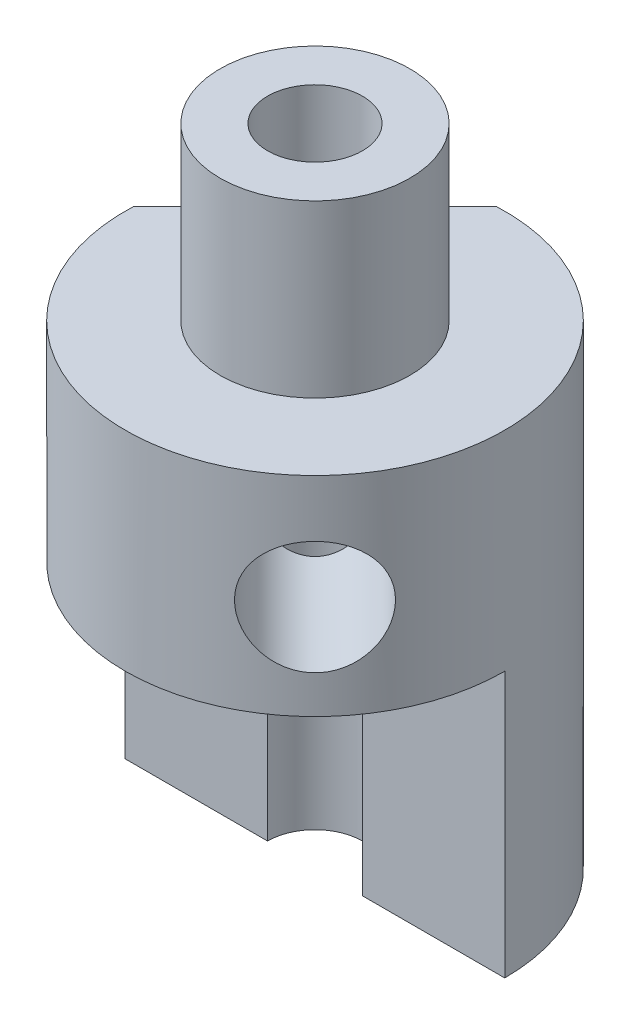
ISO-10303-21;
HEADER;
FILE_DESCRIPTION(('STEP AP214'),'2;1');
FILE_NAME('part.step','',(''),(''),'','','');
FILE_SCHEMA(('AUTOMOTIVE_DESIGN { 1 0 10303 214 1 1 1 1 }'));
ENDSEC;
DATA;
#1=APPLICATION_CONTEXT('core data for automotive mechanical design processes');
#2=APPLICATION_PROTOCOL_DEFINITION('international standard','automotive_design',2000,#1);
#3=PRODUCT_CONTEXT('',#1,'mechanical');
#4=PRODUCT('Part','Part','',(#3));
#5=PRODUCT_RELATED_PRODUCT_CATEGORY('part','',(#4));
#6=PRODUCT_DEFINITION_FORMATION('','',#4);
#7=PRODUCT_DEFINITION_CONTEXT('part definition',#1,'design');
#8=PRODUCT_DEFINITION('design','',#6,#7);
#9=PRODUCT_DEFINITION_SHAPE('','',#8);
#10=(LENGTH_UNIT() NAMED_UNIT(*) SI_UNIT(.MILLI.,.METRE.));
#11=(NAMED_UNIT(*) PLANE_ANGLE_UNIT() SI_UNIT($,.RADIAN.));
#12=(NAMED_UNIT(*) SI_UNIT($,.STERADIAN.) SOLID_ANGLE_UNIT());
#13=UNCERTAINTY_MEASURE_WITH_UNIT(LENGTH_MEASURE(1.E-05),#10,'distance_accuracy_value','');
#14=(GEOMETRIC_REPRESENTATION_CONTEXT(3) GLOBAL_UNCERTAINTY_ASSIGNED_CONTEXT((#13)) GLOBAL_UNIT_ASSIGNED_CONTEXT((#10,
#11,#12)) REPRESENTATION_CONTEXT('',''));
#15=CARTESIAN_POINT('',(0.,0.,0.));
#16=DIRECTION('',(0.,0.,1.));
#17=DIRECTION('',(1.,0.,0.));
#18=AXIS2_PLACEMENT_3D('',#15,#16,#17);
#19=CARTESIAN_POINT('',(0.,0.,0.));
#20=DIRECTION('',(0.,1.,0.));
#21=DIRECTION('',(0.,0.,1.));
#22=AXIS2_PLACEMENT_3D('',#19,#20,#21);
#23=CYLINDRICAL_SURFACE('',#22,5.);
#24=DIRECTION('',(0.,1.,0.));
#25=VECTOR('',#24,1.);
#26=CARTESIAN_POINT('',(-4.99547667712567,0.,-0.212632942634737));
#27=LINE('',#26,#25);
#28=CARTESIAN_POINT('',(-4.99547667712567,-17.,-0.212632942634736));
#29=VERTEX_POINT('',#28);
#30=CARTESIAN_POINT('',(-4.99547667712567,-4.5,-0.212632942634736));
#31=VERTEX_POINT('',#30);
#32=EDGE_CURVE('E11',#29,#31,#27,.T.);
#33=ORIENTED_EDGE('',*,*,#32,.F.);
#34=CARTESIAN_POINT('',(0.,-17.,0.));
#35=DIRECTION('',(0.,1.,0.));
#36=DIRECTION('',(0.,0.,1.));
#37=AXIS2_PLACEMENT_3D('',#34,#35,#36);
#38=CIRCLE('',#37,5.);
#39=CARTESIAN_POINT('',(-5.,-17.,0.));
#40=VERTEX_POINT('',#39);
#41=EDGE_CURVE('E99',#29,#40,#38,.T.);
#42=ORIENTED_EDGE('',*,*,#41,.T.);
#43=DIRECTION('',(0.,-1.,0.));
#44=VECTOR('',#43,1.);
#45=CARTESIAN_POINT('',(-5.,-10.,0.));
#46=LINE('',#45,#44);
#47=CARTESIAN_POINT('',(-5.,-10.,0.));
#48=VERTEX_POINT('',#47);
#49=EDGE_CURVE('E149',#48,#40,#46,.T.);
#50=ORIENTED_EDGE('',*,*,#49,.F.);
#51=CARTESIAN_POINT('',(0.,-10.,0.));
#52=DIRECTION('',(0.,-1.,0.));
#53=DIRECTION('',(0.,0.,-1.));
#54=AXIS2_PLACEMENT_3D('',#51,#52,#53);
#55=CIRCLE('',#54,5.);
#56=CARTESIAN_POINT('',(5.,-10.,0.));
#57=VERTEX_POINT('',#56);
#58=EDGE_CURVE('E135',#48,#57,#55,.F.);
#59=ORIENTED_EDGE('',*,*,#58,.T.);
#60=DIRECTION('',(0.,-1.,0.));
#61=VECTOR('',#60,1.);
#62=CARTESIAN_POINT('',(5.,-10.,0.));
#63=LINE('',#62,#61);
#64=CARTESIAN_POINT('',(5.,-17.,0.));
#65=VERTEX_POINT('',#64);
#66=EDGE_CURVE('E110',#57,#65,#63,.T.);
#67=ORIENTED_EDGE('',*,*,#66,.T.);
#68=CARTESIAN_POINT('',(-0.212632942634616,-17.,-4.99547667712567));
#69=VERTEX_POINT('',#68);
#70=EDGE_CURVE('E107',#65,#69,#38,.T.);
#71=ORIENTED_EDGE('',*,*,#70,.T.);
#72=DIRECTION('',(0.,1.,0.));
#73=VECTOR('',#72,1.);
#74=CARTESIAN_POINT('',(-0.212632942634617,0.,-4.99547667712567));
#75=LINE('',#74,#73);
#76=CARTESIAN_POINT('',(-0.212632942634617,-4.5,-4.99547667712567));
#77=VERTEX_POINT('',#76);
#78=EDGE_CURVE('E44',#77,#69,#75,.F.);
#79=ORIENTED_EDGE('',*,*,#78,.F.);
#80=CARTESIAN_POINT('',(0.,-4.5,0.));
#81=DIRECTION('',(0.,1.,0.));
#82=DIRECTION('',(0.,0.,1.));
#83=AXIS2_PLACEMENT_3D('',#80,#81,#82);
#84=CIRCLE('',#83,5.);
#85=EDGE_CURVE('E102',#31,#77,#84,.T.);
#86=ORIENTED_EDGE('',*,*,#85,.F.);
#87=EDGE_LOOP('',(#33,#42,#50,#59,#67,#71,#79,#86));
#88=FACE_BOUND('',#87,.T.);
#89=CARTESIAN_POINT('',(2.31202421902814,-7.5,4.43334456258786));
#90=CARTESIAN_POINT('',(2.31202554403836,-7.4178054520576,4.43334443992089));
#91=CARTESIAN_POINT('',(2.31833642927138,-7.33560077585598,4.4300699345926));
#92=CARTESIAN_POINT('',(2.34321564064254,-7.17359475040806,4.41695964010886));
#93=CARTESIAN_POINT('',(2.36178806233061,-7.09379421349854,4.40712165863548));
#94=CARTESIAN_POINT('',(2.41012643552735,-6.93896527172827,4.38087197181145));
#95=CARTESIAN_POINT('',(2.43987376793344,-6.86392917036692,4.36447119812477));
#96=CARTESIAN_POINT('',(2.50910131305909,-6.7203780660047,4.32504234678054));
#97=CARTESIAN_POINT('',(2.5485829827509,-6.65186404131556,4.30201327695633));
#98=CARTESIAN_POINT('',(2.63681609316764,-6.52113360942263,4.24852110256376));
#99=CARTESIAN_POINT('',(2.68580086658521,-6.45915410205372,4.2178637750193));
#100=CARTESIAN_POINT('',(2.7902521138083,-6.34536204867749,4.14950401628171));
#101=CARTESIAN_POINT('',(2.84571941932356,-6.29355080955012,4.11180068071226));
#102=CARTESIAN_POINT('',(2.962226370514,-6.20053730016669,4.0287009933826));
#103=CARTESIAN_POINT('',(3.02335752947627,-6.15957657555719,3.98316167701538));
#104=CARTESIAN_POINT('',(3.14784119759628,-6.09101274095724,3.88552984554576));
#105=CARTESIAN_POINT('',(3.21119322451307,-6.06340675014255,3.83343874682251));
#106=CARTESIAN_POINT('',(3.33595486065659,-6.02311999890949,3.72532158709201));
#107=CARTESIAN_POINT('',(3.39736819287551,-6.0100348723473,3.66945071855999));
#108=CARTESIAN_POINT('',(3.51800486407127,-5.99788267535356,3.55395675199789));
#109=CARTESIAN_POINT('',(3.57722866040967,-5.99881266059804,3.49433444469879));
#110=CARTESIAN_POINT('',(3.6898721194699,-6.01439286854303,3.37510897121297));
#111=CARTESIAN_POINT('',(3.7434165606575,-6.02860519380987,3.31556566784947));
#112=CARTESIAN_POINT('',(3.84553265451831,-6.06963133599429,3.19656530524125));
#113=CARTESIAN_POINT('',(3.89410399203609,-6.09644595094267,3.13710825169745));
#114=CARTESIAN_POINT('',(3.98596059760719,-6.16221202341856,3.01956154086991));
#115=CARTESIAN_POINT('',(4.02917770912893,-6.20130120280727,2.9614958755202));
#116=CARTESIAN_POINT('',(4.10918211709999,-6.29039785242823,2.84945063455309));
#117=CARTESIAN_POINT('',(4.14596788437744,-6.34040791296349,2.79547203243603));
#118=CARTESIAN_POINT('',(4.21419801434425,-6.4521977507516,2.69157015929375));
#119=CARTESIAN_POINT('',(4.24538181032643,-6.51435691902974,2.64188342710003));
#120=CARTESIAN_POINT('',(4.30056426843165,-6.64751001789005,2.5510738826623));
#121=CARTESIAN_POINT('',(4.32456221656939,-6.71850482538923,2.5099519215368));
#122=CARTESIAN_POINT('',(4.36561998102409,-6.86823946924899,2.4378489715776));
#123=CARTESIAN_POINT('',(4.38261105977231,-6.94704704586292,2.406969007475));
#124=CARTESIAN_POINT('',(4.40937473672971,-7.10960720844554,2.3575861421563));
#125=CARTESIAN_POINT('',(4.41914968986494,-7.19335817153456,2.33907920328661));
#126=CARTESIAN_POINT('',(4.43129408808536,-7.36008236073928,2.31598740086666));
#127=CARTESIAN_POINT('',(4.43392597648714,-7.44296822389398,2.31090933495105));
#128=CARTESIAN_POINT('',(4.43254934299383,-7.60847290000987,2.31354905591375));
#129=CARTESIAN_POINT('',(4.42854175063192,-7.69109174873085,2.32126505161221));
#130=CARTESIAN_POINT('',(4.41406686187904,-7.85148837797087,2.34866786614158));
#131=CARTESIAN_POINT('',(4.40377008472262,-7.92933616426352,2.36803849140195));
#132=CARTESIAN_POINT('',(4.37683342493547,-8.08040169081492,2.41746064794916));
#133=CARTESIAN_POINT('',(4.36019256290481,-8.15361871414057,2.44751382836057));
#134=CARTESIAN_POINT('',(4.31998194950394,-8.29551746407213,2.5178231442573));
#135=CARTESIAN_POINT('',(4.29623821612194,-8.36402472098579,2.55833147498572));
#136=CARTESIAN_POINT('',(4.24195838032207,-8.4926381061808,2.64735761279482));
#137=CARTESIAN_POINT('',(4.21142065181078,-8.55274221761279,2.69587733662628));
#138=CARTESIAN_POINT('',(4.14229620181627,-8.66518040581474,2.80097809014154));
#139=CARTESIAN_POINT('',(4.10344920377482,-8.71713562898698,2.85779424855102));
#140=CARTESIAN_POINT('',(4.0187072541858,-8.80896670102775,2.97577879668649));
#141=CARTESIAN_POINT('',(3.97281265282395,-8.84884314978146,3.03694697008586));
#142=CARTESIAN_POINT('',(3.87494177347524,-8.9150000305683,3.1608551345975));
#143=CARTESIAN_POINT('',(3.82301464229707,-8.94138201615898,3.2235795452011));
#144=CARTESIAN_POINT('',(3.71385899712308,-8.98006091889042,3.34875152909497));
#145=CARTESIAN_POINT('',(3.65663200498938,-8.99236186594842,3.41119917649425));
#146=CARTESIAN_POINT('',(3.54070822676473,-9.0022230440545,3.53130066052485));
#147=CARTESIAN_POINT('',(3.48215291031679,-9.00033269540783,3.58904649569499));
#148=CARTESIAN_POINT('',(3.36332028629709,-8.98317836750088,3.70063777145006));
#149=CARTESIAN_POINT('',(3.30304307654892,-8.96791514651956,3.75448343299824));
#150=CARTESIAN_POINT('',(3.18337766679835,-8.92478833860038,3.85645254842059));
#151=CARTESIAN_POINT('',(3.12398687100955,-8.89706181935099,3.90463124048538));
#152=CARTESIAN_POINT('',(3.00739315885611,-8.82991808549281,3.9951269160973));
#153=CARTESIAN_POINT('',(2.95019060377821,-8.79049894971381,4.03744293469287));
#154=CARTESIAN_POINT('',(2.83814119214532,-8.69962654256996,4.11701719288622));
#155=CARTESIAN_POINT('',(2.78342827695233,-8.64782856999923,4.15407027313075));
#156=CARTESIAN_POINT('',(2.68042812035858,-8.5342896116672,4.22126693047114));
#157=CARTESIAN_POINT('',(2.63214273702938,-8.47254576210185,4.25140851140175));
#158=CARTESIAN_POINT('',(2.54264575594487,-8.33865922168949,4.305551624071));
#159=CARTESIAN_POINT('',(2.50168788044889,-8.26626144660956,4.32934338024627));
#160=CARTESIAN_POINT('',(2.43066707268165,-8.11444482583898,4.36961486920421));
#161=CARTESIAN_POINT('',(2.40059890579733,-8.03502937639881,4.38609811599731));
#162=CARTESIAN_POINT('',(2.35555564624654,-7.88025956839373,4.41043542393915));
#163=CARTESIAN_POINT('',(2.33930224282493,-7.80539135306901,4.41902857163297));
#164=CARTESIAN_POINT('',(2.31753698650748,-7.65368477750423,4.43048262371999));
#165=CARTESIAN_POINT('',(2.31202298022558,-7.57684681535475,4.43334467727388));
#166=CARTESIAN_POINT('',(2.31202421902814,-7.5,4.43334456258786));
#167=B_SPLINE_CURVE_WITH_KNOTS('',3,(#89,#90,#91,#92,#93,#94,#95,#96,#97,#98,#99,#100,#101,#102,
#103,#104,#105,#106,#107,#108,#109,#110,#111,#112,#113,#114,#115,#116,#117,#118,#119,#120,#121,
#122,#123,#124,#125,#126,#127,#128,#129,#130,#131,#132,#133,#134,#135,#136,#137,#138,#139,#140,
#141,#142,#143,#144,#145,#146,#147,#148,#149,#150,#151,#152,#153,#154,#155,#156,#157,#158,#159,
#160,#161,#162,#163,#164,#165,#166),.UNSPECIFIED.,.T.,.F.,(4,2,2,2,2,2,2,2,2,2,2,2,2,2,2,2,2,2,
2,2,2,2,2,2,2,2,2,2,2,2,2,2,2,2,2,2,2,2,4),(0.,0.246300165915542,0.492682641688999,
0.738656414466192,0.984667025370099,1.23773150007984,1.49082847871273,1.74915939273644,
2.00743455587877,2.25832140149557,2.5091555410144,2.7520012599088,2.99486235890376,
3.24055209335676,3.4863001659083,3.74152147023277,3.99676812491863,4.25446238246266,
4.51207250628411,4.76008080790309,5.00805439107387,5.24958594938817,5.49115481045787,
5.73920731809388,5.98731925928922,6.24479506100602,6.50225807324202,6.75775391814325,
7.01317662321682,7.2587630391122,7.50433553047754,7.74727096872218,7.99024634491378,
8.24099627054488,8.4918185262989,8.75011639669147,9.00828993963944,9.23861153857447,
9.46888695033559),.UNSPECIFIED.);
#168=CARTESIAN_POINT('',(2.31202421902814,-7.5,4.43334456258786));
#169=VERTEX_POINT('',#168);
#170=EDGE_CURVE('E280',#169,#169,#167,.T.);
#171=ORIENTED_EDGE('',*,*,#170,.T.);
#172=EDGE_LOOP('',(#171));
#173=FACE_BOUND('',#172,.T.);
#174=ADVANCED_FACE('F35',(#88,#173),#23,.T.);
#175=CARTESIAN_POINT('',(0.,0.,0.));
#176=DIRECTION('',(0.,1.,0.));
#177=DIRECTION('',(0.,0.,1.));
#178=AXIS2_PLACEMENT_3D('',#175,#176,#177);
#179=CYLINDRICAL_SURFACE('',#178,1.25);
#180=CARTESIAN_POINT('',(0.,-17.,0.));
#181=DIRECTION('',(0.,1.,0.));
#182=DIRECTION('',(0.,0.,1.));
#183=AXIS2_PLACEMENT_3D('',#180,#181,#182);
#184=CIRCLE('',#183,1.25);
#185=CARTESIAN_POINT('',(1.25,-17.,0.));
#186=VERTEX_POINT('',#185);
#187=CARTESIAN_POINT('',(-1.25,-17.,0.));
#188=VERTEX_POINT('',#187);
#189=EDGE_CURVE('E109',#186,#188,#184,.T.);
#190=ORIENTED_EDGE('',*,*,#189,.F.);
#191=DIRECTION('',(0.,-1.,0.));
#192=VECTOR('',#191,1.);
#193=CARTESIAN_POINT('',(1.25,-10.,0.));
#194=LINE('',#193,#192);
#195=CARTESIAN_POINT('',(1.25,-10.,0.));
#196=VERTEX_POINT('',#195);
#197=EDGE_CURVE('E145',#196,#186,#194,.T.);
#198=ORIENTED_EDGE('',*,*,#197,.F.);
#199=CARTESIAN_POINT('',(0.,-10.,0.));
#200=DIRECTION('',(0.,-1.,0.));
#201=DIRECTION('',(0.,0.,-1.));
#202=AXIS2_PLACEMENT_3D('',#199,#200,#201);
#203=CIRCLE('',#202,1.25);
#204=CARTESIAN_POINT('',(-1.25,-10.,0.));
#205=VERTEX_POINT('',#204);
#206=EDGE_CURVE('E141',#205,#196,#203,.F.);
#207=ORIENTED_EDGE('',*,*,#206,.F.);
#208=DIRECTION('',(0.,-1.,0.));
#209=VECTOR('',#208,1.);
#210=CARTESIAN_POINT('',(-1.25,-10.,0.));
#211=LINE('',#210,#209);
#212=EDGE_CURVE('E147',#205,#188,#211,.T.);
#213=ORIENTED_EDGE('',*,*,#212,.T.);
#214=EDGE_LOOP('',(#190,#198,#207,#213));
#215=FACE_BOUND('',#214,.T.);
#216=CARTESIAN_POINT('',(0.,-8.71191996435409,1.25));
#217=CARTESIAN_POINT('',(0.0639913786883656,-8.74491737996399,1.25000210695445));
#218=CARTESIAN_POINT('',(0.128616767662696,-8.77688583088534,1.24509719611039));
#219=CARTESIAN_POINT('',(0.258294541845827,-8.83666040379786,1.22478126862897));
#220=CARTESIAN_POINT('',(0.323347336264017,-8.86446164140774,1.20935803914988));
#221=CARTESIAN_POINT('',(0.441671247693465,-8.90968201894588,1.17074105287275));
#222=CARTESIAN_POINT('',(0.495122135055814,-8.92805644328683,1.14924019172275));
#223=CARTESIAN_POINT('',(0.599796765359746,-8.95912297532618,1.09823675348599));
#224=CARTESIAN_POINT('',(0.651023107976122,-8.97182188628122,1.06874382503994));
#225=CARTESIAN_POINT('',(0.74990357411805,-8.99056999301902,1.00186104326818));
#226=CARTESIAN_POINT('',(0.797533555210043,-8.99657743111183,0.964423317014416));
#227=CARTESIAN_POINT('',(0.887031420698439,-9.00121689671856,0.882801857054179));
#228=CARTESIAN_POINT('',(0.928900542896059,-8.99985051114752,0.838619576826768));
#229=CARTESIAN_POINT('',(1.00158743680936,-8.99039163423168,0.749854910127929));
#230=CARTESIAN_POINT('',(1.03309189631108,-8.98298605598361,0.705755200232642));
#231=CARTESIAN_POINT('',(1.08969812090732,-8.96288872286083,0.614760813845057));
#232=CARTESIAN_POINT('',(1.11479861218082,-8.95019591761728,0.567865583577391));
#233=CARTESIAN_POINT('',(1.15957996065309,-8.91956921032483,0.470021603129293));
#234=CARTESIAN_POINT('',(1.17891046603615,-8.90139677091312,0.418988942514881));
#235=CARTESIAN_POINT('',(1.2105123063233,-8.86119815932786,0.316306111798867));
#236=CARTESIAN_POINT('',(1.22278221530482,-8.83917120988736,0.264655819111829));
#237=CARTESIAN_POINT('',(1.24483493911936,-8.78128814921685,0.137184121716145));
#238=CARTESIAN_POINT('',(1.25072990818731,-8.74380225398072,0.0614266155994452));
#239=CARTESIAN_POINT('',(1.24912050790715,-8.66589103957398,-0.0887794993168474));
#240=CARTESIAN_POINT('',(1.24155366970181,-8.62545285598344,-0.163220378518302));
#241=CARTESIAN_POINT('',(1.22019569515393,-8.56517196613941,-0.27398153283932));
#242=CARTESIAN_POINT('',(1.21127695073219,-8.54495462647527,-0.311093114094432));
#243=CARTESIAN_POINT('',(1.18991084432896,-8.50540589727714,-0.384821518532987));
#244=CARTESIAN_POINT('',(1.17746133875979,-8.48607505425888,-0.421438026956768));
#245=CARTESIAN_POINT('',(1.14894616850438,-8.44927258255515,-0.493891514925132));
#246=CARTESIAN_POINT('',(1.13290354041102,-8.43179011064349,-0.52973193185923));
#247=CARTESIAN_POINT('',(1.09691425500736,-8.39968661839554,-0.60071603443615));
#248=CARTESIAN_POINT('',(1.07697208864192,-8.38506234476099,-0.635860470817283));
#249=CARTESIAN_POINT('',(1.03344256035427,-8.36039175211665,-0.70434511822623));
#250=CARTESIAN_POINT('',(1.00994838357554,-8.35024890894429,-0.737708183030415));
#251=CARTESIAN_POINT('',(0.959136796972213,-8.33554565964795,-0.80265008286533));
#252=CARTESIAN_POINT('',(0.93182900767431,-8.33097147931186,-0.834233135292896));
#253=CARTESIAN_POINT('',(0.873871659525528,-8.32822754459682,-0.894768055097566));
#254=CARTESIAN_POINT('',(0.843207938193949,-8.33008603201193,-0.923707745655071));
#255=CARTESIAN_POINT('',(0.779672245203064,-8.33990059291759,-0.977938892870945));
#256=CARTESIAN_POINT('',(0.746796142836668,-8.34786837829995,-1.00322323121391));
#257=CARTESIAN_POINT('',(0.667943814005957,-8.37224463613022,-1.05801940414384));
#258=CARTESIAN_POINT('',(0.621445878947159,-8.39064147178175,-1.08586484174716));
#259=CARTESIAN_POINT('',(0.527176124766108,-8.43267214900889,-1.13464581844197));
#260=CARTESIAN_POINT('',(0.479400428437407,-8.45632403128735,-1.15555692003294));
#261=CARTESIAN_POINT('',(0.35717664362971,-8.51950874331464,-1.20047708534858));
#262=CARTESIAN_POINT('',(0.282065956519095,-8.56079409397429,-1.22021160588195));
#263=CARTESIAN_POINT('',(0.12972796734972,-8.64365076815513,-1.24564032938096));
#264=CARTESIAN_POINT('',(0.0525008461215014,-8.68522206701866,-1.25133572810693));
#265=CARTESIAN_POINT('',(-0.0910138617065213,-8.75840498851754,-1.248399495708));
#266=CARTESIAN_POINT('',(-0.157070103564298,-8.79054480135942,-1.24191860563906));
#267=CARTESIAN_POINT('',(-0.289285672071318,-8.85009141354749,-1.21791199343543));
#268=CARTESIAN_POINT('',(-0.355444578557473,-8.87750690374818,-1.20040683384736));
#269=CARTESIAN_POINT('',(-0.473467317390121,-8.92073645855639,-1.15821282483365));
#270=CARTESIAN_POINT('',(-0.525614008743689,-8.93776942663956,-1.13557696215403));
#271=CARTESIAN_POINT('',(-0.62750905946018,-8.9661642075414,-1.08259958583015));
#272=CARTESIAN_POINT('',(-0.677258817046268,-8.97752936370034,-1.05226263089827));
#273=CARTESIAN_POINT('',(-0.772970870893696,-8.99370192082122,-0.984115014765441));
#274=CARTESIAN_POINT('',(-0.818912013850891,-8.99847473852648,-0.946266122330847));
#275=CARTESIAN_POINT('',(-0.905010359228078,-9.00089983293811,-0.864283974372007));
#276=CARTESIAN_POINT('',(-0.945168712813636,-8.99855352888865,-0.820151973098964));
#277=CARTESIAN_POINT('',(-1.01529240839729,-8.98746868505614,-0.731175318443245));
#278=CARTESIAN_POINT('',(-1.04583395708875,-8.97929032603971,-0.686709959551219));
#279=CARTESIAN_POINT('',(-1.10049938118665,-8.95777839029016,-0.595184420524482));
#280=CARTESIAN_POINT('',(-1.12462231469959,-8.94444405765218,-0.54812386078142));
#281=CARTESIAN_POINT('',(-1.16769361000842,-8.91246455367466,-0.449522946650931));
#282=CARTESIAN_POINT('',(-1.18621060568325,-8.89353350217981,-0.397888905652792));
#283=CARTESIAN_POINT('',(-1.21611241340148,-8.85189415556672,-0.294096728895034));
#284=CARTESIAN_POINT('',(-1.2274921196427,-8.82918317106083,-0.241938245004011));
#285=CARTESIAN_POINT('',(-1.24729987628377,-8.76962499517042,-0.113074955459363));
#286=CARTESIAN_POINT('',(-1.25175387657247,-8.73118968796835,-0.0364870247662707));
#287=CARTESIAN_POINT('',(-1.24701092189119,-8.65180227960552,0.11506554160672));
#288=CARTESIAN_POINT('',(-1.23778247192808,-8.61084458043672,0.190026027828414));
#289=CARTESIAN_POINT('',(-1.2088288619225,-8.53792975806346,0.324066270173044));
#290=CARTESIAN_POINT('',(-1.19137665164405,-8.50571607997761,0.383505393167127));
#291=CARTESIAN_POINT('',(-1.1469648004916,-8.44543133153045,0.500892321939778));
#292=CARTESIAN_POINT('',(-1.12003448865478,-8.41734785651785,0.5588441431291));
#293=CARTESIAN_POINT('',(-1.06764328727076,-8.37909395486163,0.651390963288159));
#294=CARTESIAN_POINT('',(-1.0453881561511,-8.36615034285388,0.686627732153198));
#295=CARTESIAN_POINT('',(-0.996633755751571,-8.34553022214565,0.755643582496845));
#296=CARTESIAN_POINT('',(-0.970144977600721,-8.33784093526674,0.789426011813616));
#297=CARTESIAN_POINT('',(-0.913036264094464,-8.32905408490871,0.854845392716064));
#298=CARTESIAN_POINT('',(-0.882382075697136,-8.32801503256329,0.886460885246448));
#299=CARTESIAN_POINT('',(-0.81819867067286,-8.33291850302415,0.946030624879117));
#300=CARTESIAN_POINT('',(-0.784666763910265,-8.33886762585638,0.973981383066734));
#301=CARTESIAN_POINT('',(-0.709065712974322,-8.35832794691052,1.03072281006568));
#302=CARTESIAN_POINT('',(-0.666629269283545,-8.37311239373292,1.05856582599198));
#303=CARTESIAN_POINT('',(-0.580417775597228,-8.40816274738504,1.10819991381155));
#304=CARTESIAN_POINT('',(-0.536638022786261,-8.42845049060205,1.12996616030783));
#305=CARTESIAN_POINT('',(-0.422293396742047,-8.48485320266131,1.17898547766517));
#306=CARTESIAN_POINT('',(-0.351064633093779,-8.52327671508222,1.2019806935062));
#307=CARTESIAN_POINT('',(-0.206784956036501,-8.60170312314096,1.23498543905344));
#308=CARTESIAN_POINT('',(-0.133738463117573,-8.64170230331951,1.24502382984105));
#309=CARTESIAN_POINT('',(-0.0400085050771244,-8.69115649981847,1.24951765569385));
#310=CARTESIAN_POINT('',(-0.0200353279067717,-8.70158866574213,1.24999934032484));
#311=CARTESIAN_POINT('',(0.,-8.71191996435409,1.25));
#312=B_SPLINE_CURVE_WITH_KNOTS('',3,(#216,#217,#218,#219,#220,#221,#222,#223,#224,#225,#226,
#227,#228,#229,#230,#231,#232,#233,#234,#235,#236,#237,#238,#239,#240,#241,#242,#243,#244,#245,
#246,#247,#248,#249,#250,#251,#252,#253,#254,#255,#256,#257,#258,#259,#260,#261,#262,#263,#264,
#265,#266,#267,#268,#269,#270,#271,#272,#273,#274,#275,#276,#277,#278,#279,#280,#281,#282,#283,
#284,#285,#286,#287,#288,#289,#290,#291,#292,#293,#294,#295,#296,#297,#298,#299,#300,#301,#302,
#303,#304,#305,#306,#307,#308,#309,#310,#311),.UNSPECIFIED.,.T.,.F.,(4,2,2,2,2,2,2,2,2,2,2,2,2,
2,2,2,2,2,2,2,2,2,2,2,2,2,2,2,2,2,2,2,2,2,2,2,2,2,2,2,2,2,2,2,2,2,2,4),(0.,0.215942088817363,
0.432135336286967,0.612810461533716,0.793268426191593,0.974846325336831,1.15638514879789,
1.31975352556997,1.48315437285179,1.65506547281691,1.82701127891013,2.07987565995776,
2.33391650821602,2.46337142686316,2.5929051087548,2.72163094675353,2.85020940022983,
2.97586451209178,3.10120817756057,3.2271028448821,3.35323946515133,3.52397673782453,
3.69530947007379,3.95782981308986,4.22032779557178,4.44073753159086,4.66073737046146,
4.83804894938601,5.01525581131735,5.19338881027804,5.37148629957655,5.53444842161385,
5.69743444419846,5.87087889962719,6.04444729090427,6.3005169944633,6.55717704876748,
6.76607448766468,6.97433111680159,7.10482904357784,7.23500846745713,7.36633169974772,
7.497779060879,7.65548542580041,7.81382694199065,8.06494624332283,8.31550521034161,
8.3831154204513),.UNSPECIFIED.);
#313=CARTESIAN_POINT('',(0.,-8.71191996435409,1.25));
#314=VERTEX_POINT('',#313);
#315=EDGE_CURVE('E276',#314,#314,#312,.T.);
#316=ORIENTED_EDGE('',*,*,#315,.T.);
#317=EDGE_LOOP('',(#316));
#318=FACE_BOUND('',#317,.T.);
#319=ADVANCED_FACE('F158',(#215,#318),#179,.F.);
#320=CARTESIAN_POINT('',(0.,0.,0.));
#321=DIRECTION('',(0.,1.,0.));
#322=DIRECTION('',(0.,0.,1.));
#323=AXIS2_PLACEMENT_3D('',#320,#321,#322);
#324=CIRCLE('',#323,1.25);
#325=CARTESIAN_POINT('',(0.,0.,1.25));
#326=VERTEX_POINT('',#325);
#327=EDGE_CURVE('E115',#326,#326,#324,.T.);
#328=ORIENTED_EDGE('',*,*,#327,.T.);
#329=EDGE_LOOP('',(#328));
#330=FACE_BOUND('',#329,.T.);
#331=CARTESIAN_POINT('',(0.,-6.28808003564591,1.25));
#332=CARTESIAN_POINT('',(-0.0751066164882324,-6.32681779560285,1.25000389360511));
#333=CARTESIAN_POINT('',(-0.149497866458085,-6.36706797556724,1.2432605841613));
#334=CARTESIAN_POINT('',(-0.29638321409407,-6.44702955691301,1.21665610642222));
#335=CARTESIAN_POINT('',(-0.36887414468372,-6.48674001158207,1.19677432787151));
#336=CARTESIAN_POINT('',(-0.484705644884422,-6.54627369595562,1.15317129403304));
#337=CARTESIAN_POINT('',(-0.528709825512166,-6.56794132271759,1.1337402591407));
#338=CARTESIAN_POINT('',(-0.615633073808181,-6.60683338055464,1.08897865544203));
#339=CARTESIAN_POINT('',(-0.658554860618621,-6.62407021594477,1.06366494295229));
#340=CARTESIAN_POINT('',(-0.733518780439923,-6.64845335217027,1.01293142365959));
#341=CARTESIAN_POINT('',(-0.765910723937564,-6.6569741877867,0.988712159605399));
#342=CARTESIAN_POINT('',(-0.828727599101664,-6.66830240973103,0.936678356429567));
#343=CARTESIAN_POINT('',(-0.859155685628166,-6.67111919234287,0.908869810465138));
#344=CARTESIAN_POINT('',(-0.917116467691891,-6.67052458232797,0.850350824700695));
#345=CARTESIAN_POINT('',(-0.944644038061713,-6.66710235440964,0.819635424413032));
#346=CARTESIAN_POINT('',(-0.996059910965049,-6.65464947482899,0.756330376773262));
#347=CARTESIAN_POINT('',(-1.01994151391763,-6.64560864972191,0.723737427135976));
#348=CARTESIAN_POINT('',(-1.0737397471294,-6.61823465379554,0.642579251571137));
#349=CARTESIAN_POINT('',(-1.10153761043937,-6.59755080637787,0.593425281221329));
#350=CARTESIAN_POINT('',(-1.1496610440693,-6.55112740877921,0.493821115699947));
#351=CARTESIAN_POINT('',(-1.1699588043539,-6.52536957489163,0.443366823932812));
#352=CARTESIAN_POINT('',(-1.21176727660066,-6.4586591988242,0.31692962096146));
#353=CARTESIAN_POINT('',(-1.22919032196432,-6.41634429758446,0.240309219515835));
#354=CARTESIAN_POINT('',(-1.2495598884341,-6.33226748810222,0.0849559329349242));
#355=CARTESIAN_POINT('',(-1.25251652920637,-6.29050521368218,0.00622456325842299));
#356=CARTESIAN_POINT('',(-1.24411909921366,-6.21927500724779,-0.136849212003685));
#357=CARTESIAN_POINT('',(-1.23548655494581,-6.18901131267931,-0.200949034858037));
#358=CARTESIAN_POINT('',(-1.20770440994196,-6.13335874319752,-0.328973558832906));
#359=CARTESIAN_POINT('',(-1.18857280778735,-6.10796162573516,-0.392898372022502));
#360=CARTESIAN_POINT('',(-1.14366571435328,-6.06801119566876,-0.507551922461677));
#361=CARTESIAN_POINT('',(-1.11969726860939,-6.05232997223965,-0.558591093781308));
#362=CARTESIAN_POINT('',(-1.064304776458,-6.02669854395747,-0.658016926577198));
#363=CARTESIAN_POINT('',(-1.03288506217506,-6.01674502053141,-0.706405109274847));
#364=CARTESIAN_POINT('',(-0.962947773043273,-6.00335454181665,-0.799135106346789));
#365=CARTESIAN_POINT('',(-0.924398934793279,-5.99994707317112,-0.843457758980941));
#366=CARTESIAN_POINT('',(-0.841447911144842,-6.00005415439554,-0.926227217757766));
#367=CARTESIAN_POINT('',(-0.797046173048123,-6.00356817558375,-0.964674472437195));
#368=CARTESIAN_POINT('',(-0.707384900400417,-6.01668926609086,-1.03199883429039));
#369=CARTESIAN_POINT('',(-0.662423958527656,-6.02583339592312,-1.06136932954962));
#370=CARTESIAN_POINT('',(-0.570141920308055,-6.04912385405687,-1.11366661385139));
#371=CARTESIAN_POINT('',(-0.522820481318105,-6.06327091039464,-1.13659246418379));
#372=CARTESIAN_POINT('',(-0.423165153821131,-6.09698841809739,-1.17752252639813));
#373=CARTESIAN_POINT('',(-0.370730405950716,-6.1168987550218,-1.19499557407151));
#374=CARTESIAN_POINT('',(-0.265478616713372,-6.16038974196731,-1.22269714571743));
#375=CARTESIAN_POINT('',(-0.21266129117645,-6.18397346151465,-1.23291957093712));
#376=CARTESIAN_POINT('',(-0.0822487308200696,-6.24554371768233,-1.24975475814821));
#377=CARTESIAN_POINT('',(-0.00483776075156879,-6.28503888773283,-1.25232719841867));
#378=CARTESIAN_POINT('',(0.14820399118363,-6.3660945367619,-1.24355865840393));
#379=CARTESIAN_POINT('',(0.223831006361578,-6.40765889379971,-1.23219053070354));
#380=CARTESIAN_POINT('',(0.354883638076497,-6.47869909752492,-1.1999761767886));
#381=CARTESIAN_POINT('',(0.410776607506161,-6.50866992494182,-1.18208242777987));
#382=CARTESIAN_POINT('',(0.521207755832378,-6.56441644563114,-1.13770316681495));
#383=CARTESIAN_POINT('',(0.575749432537102,-6.59020420508509,-1.1112430510075));
#384=CARTESIAN_POINT('',(0.664557529258608,-6.62584775793211,-1.05949225103629));
#385=CARTESIAN_POINT('',(0.699387562220642,-6.63813692940148,-1.0368876600293));
#386=CARTESIAN_POINT('',(0.767512396172056,-6.6573383959165,-0.987514608922703));
#387=CARTESIAN_POINT('',(0.800810680186863,-6.66426352114139,-0.960756269468519));
#388=CARTESIAN_POINT('',(0.865122663030648,-6.67151766062904,-0.903289365423383));
#389=CARTESIAN_POINT('',(0.89611684377382,-6.67179558802278,-0.872552030667911));
#390=CARTESIAN_POINT('',(0.954422901149623,-6.6655604726782,-0.808371128802168));
#391=CARTESIAN_POINT('',(0.981729976239312,-6.65903866949919,-0.774924121946537));
#392=CARTESIAN_POINT('',(1.03800967561376,-6.63826503506585,-0.698423626340192));
#393=CARTESIAN_POINT('',(1.06586357220627,-6.62255593794857,-0.654960874653045));
#394=CARTESIAN_POINT('',(1.11529023572172,-6.58572172347717,-0.566746190518316));
#395=CARTESIAN_POINT('',(1.13684178540785,-6.56457875137398,-0.521990448257909));
#396=CARTESIAN_POINT('',(1.18487487296391,-6.50636408179355,-0.405603744037755));
#397=CARTESIAN_POINT('',(1.20707589470551,-6.46711944828447,-0.333304240917395));
#398=CARTESIAN_POINT('',(1.2382623503146,-6.3872779946904,-0.186619647530565));
#399=CARTESIAN_POINT('',(1.24722794466501,-6.34667923776922,-0.11223159631551));
#400=CARTESIAN_POINT('',(1.25174096785245,-6.26679259841,0.0404080523772611));
#401=CARTESIAN_POINT('',(1.2469059836297,-6.22757316632042,0.118709515924358));
#402=CARTESIAN_POINT('',(1.22179119480032,-6.1554435564193,0.275669109509984));
#403=CARTESIAN_POINT('',(1.20156233340742,-6.12251301540679,0.354325214209389));
#404=CARTESIAN_POINT('',(1.15388801850149,-6.0757651342004,0.483872435260806));
#405=CARTESIAN_POINT('',(1.13095357007981,-6.05921761029524,0.535445813447011));
#406=CARTESIAN_POINT('',(1.0775268978953,-6.03175762695986,0.6361403062091));
#407=CARTESIAN_POINT('',(1.04704046885761,-6.02084086668105,0.685263266461202));
#408=CARTESIAN_POINT('',(0.978768852011823,-6.00548767356072,0.779692931059562));
#409=CARTESIAN_POINT('',(0.940947524603067,-6.00108429978848,0.824979074557077));
#410=CARTESIAN_POINT('',(0.859193611000392,-5.99927163270982,0.909809642493936));
#411=CARTESIAN_POINT('',(0.81526213687081,-6.00186106826776,0.94935510908236));
#412=CARTESIAN_POINT('',(0.726446087715025,-6.0133202185281,1.01867824706475));
#413=CARTESIAN_POINT('',(0.681897314157149,-6.02168931989434,1.04897449560634));
#414=CARTESIAN_POINT('',(0.590239564134431,-6.04355256561787,1.10315648665622));
#415=CARTESIAN_POINT('',(0.543129462572703,-6.05704897805609,1.12703938420836));
#416=CARTESIAN_POINT('',(0.444298031376604,-6.08938013044499,1.16969737781952));
#417=CARTESIAN_POINT('',(0.392480550679908,-6.10851463493161,1.1880166959409));
#418=CARTESIAN_POINT('',(0.288390939939035,-6.15053040881089,1.21747992900756));
#419=CARTESIAN_POINT('',(0.236119007928536,-6.17341011675035,1.22862682477534));
#420=CARTESIAN_POINT('',(0.153176145468082,-6.21190694743936,1.24097079547977));
#421=CARTESIAN_POINT('',(0.122410045731989,-6.22666954203343,1.2443725073358));
#422=CARTESIAN_POINT('',(0.0610567114413779,-6.25689843510847,1.24888639416559));
#423=CARTESIAN_POINT('',(0.0304694886331048,-6.27236477922953,1.24999842043002));
#424=CARTESIAN_POINT('',(0.,-6.28808003564591,1.25));
#425=B_SPLINE_CURVE_WITH_KNOTS('',3,(#331,#332,#333,#334,#335,#336,#337,#338,#339,#340,#341,
#342,#343,#344,#345,#346,#347,#348,#349,#350,#351,#352,#353,#354,#355,#356,#357,#358,#359,#360,
#361,#362,#363,#364,#365,#366,#367,#368,#369,#370,#371,#372,#373,#374,#375,#376,#377,#378,#379,
#380,#381,#382,#383,#384,#385,#386,#387,#388,#389,#390,#391,#392,#393,#394,#395,#396,#397,#398,
#399,#400,#401,#402,#403,#404,#405,#406,#407,#408,#409,#410,#411,#412,#413,#414,#415,#416,#417,
#418,#419,#420,#421,#422,#423,#424),.UNSPECIFIED.,.T.,.F.,(4,2,2,2,2,2,2,2,2,2,2,2,2,2,2,2,2,2,
2,2,2,2,2,2,2,2,2,2,2,2,2,2,2,2,2,2,2,2,2,2,2,2,2,2,2,2,4),(0.,0.253424737849244,
0.507247968624724,0.66515144147496,0.822607915740772,0.946102456322965,1.06939339837404,
1.1928986638519,1.31662821121181,1.49602408418971,1.67607862778507,1.94249310319915,
2.20872118735355,2.42215672755281,2.63522751210126,2.81008296572795,2.9848370075569,
3.16037639839471,3.3359023815884,3.49863035946598,3.66138202760875,3.8369772552079,
4.01272000751697,4.27219486896229,4.53217582683814,4.72936267128358,4.92597020134117,
5.05544072865734,5.18460061285802,5.31475283570225,5.44507294776067,5.60604276110938,
5.76754840992332,6.02183661074739,6.2765055964412,6.53829937511921,6.7992305426702,
6.97498881942636,7.15061265024019,7.32712484729578,7.50360496055934,7.66645174325242,
7.82937064572862,8.00332926401704,8.1772155392072,8.28001900809219,8.38282915359322),.UNSPECIFIED.);
#426=CARTESIAN_POINT('',(0.,-6.28808003564591,1.25));
#427=VERTEX_POINT('',#426);
#428=EDGE_CURVE('E272',#427,#427,#425,.T.);
#429=ORIENTED_EDGE('',*,*,#428,.T.);
#430=EDGE_LOOP('',(#429));
#431=FACE_BOUND('',#430,.T.);
#432=ADVANCED_FACE('F178',(#330,#431),#179,.F.);
#433=CARTESIAN_POINT('',(3.06478765097004,0.,-8.27289727073025));
#434=DIRECTION('',(-0.707106781186539,0.,-0.707106781186556));
#435=DIRECTION('',(-0.707106781186556,0.,0.707106781186539));
#436=AXIS2_PLACEMENT_3D('',#433,#434,#435);
#437=PLANE('',#436);
#438=DIRECTION('',(0.707106781186556,0.,-0.707106781186539));
#439=VECTOR('',#438,1.);
#440=CARTESIAN_POINT('',(-1.35405480988014,-4.5,-3.85405480988017));
#441=LINE('',#440,#439);
#442=EDGE_CURVE('E50',#31,#77,#441,.T.);
#443=ORIENTED_EDGE('',*,*,#442,.T.);
#444=ORIENTED_EDGE('',*,*,#78,.T.);
#445=DIRECTION('',(0.707106781186556,0.,-0.707106781186539));
#446=VECTOR('',#445,1.);
#447=CARTESIAN_POINT('',(3.06478765097004,-17.,-8.27289727073025));
#448=LINE('',#447,#446);
#449=EDGE_CURVE('E86',#29,#69,#448,.T.);
#450=ORIENTED_EDGE('',*,*,#449,.F.);
#451=ORIENTED_EDGE('',*,*,#32,.T.);
#452=EDGE_LOOP('',(#443,#444,#450,#451));
#453=FACE_BOUND('',#452,.T.);
#454=CARTESIAN_POINT('',(-2.60405480988014,-7.5,-2.60405480988021));
#455=DIRECTION('',(-0.707106781186539,0.,-0.707106781186556));
#456=DIRECTION('',(-0.707106781186556,0.,0.707106781186539));
#457=AXIS2_PLACEMENT_3D('',#454,#455,#456);
#458=CIRCLE('',#457,1.5);
#459=CARTESIAN_POINT('',(-3.66471498165998,-7.5,-1.5433946381004));
#460=VERTEX_POINT('',#459);
#461=EDGE_CURVE('E39',#460,#460,#458,.F.);
#462=ORIENTED_EDGE('',*,*,#461,.T.);
#463=EDGE_LOOP('',(#462));
#464=FACE_BOUND('',#463,.T.);
#465=ADVANCED_FACE('F88',(#453,#464),#437,.T.);
#466=CARTESIAN_POINT('',(0.,-4.5,-2.5));
#467=DIRECTION('',(0.,-1.,0.));
#468=DIRECTION('',(0.,0.,-1.));
#469=AXIS2_PLACEMENT_3D('',#466,#467,#468);
#470=PLANE('',#469);
#471=CARTESIAN_POINT('',(0.,-4.5,0.));
#472=DIRECTION('',(0.,1.,0.));
#473=DIRECTION('',(0.,0.,1.));
#474=AXIS2_PLACEMENT_3D('',#471,#472,#473);
#475=CIRCLE('',#474,2.5);
#476=CARTESIAN_POINT('',(0.,-4.5,2.5));
#477=VERTEX_POINT('',#476);
#478=EDGE_CURVE('E121',#477,#477,#475,.T.);
#479=ORIENTED_EDGE('',*,*,#478,.F.);
#480=EDGE_LOOP('',(#479));
#481=FACE_BOUND('',#480,.T.);
#482=ORIENTED_EDGE('',*,*,#442,.F.);
#483=ORIENTED_EDGE('',*,*,#85,.T.);
#484=EDGE_LOOP('',(#482,#483));
#485=FACE_BOUND('',#484,.T.);
#486=ADVANCED_FACE('F37',(#481,#485),#470,.F.);
#487=CARTESIAN_POINT('',(0.,-17.,-5.));
#488=DIRECTION('',(0.,1.,0.));
#489=DIRECTION('',(0.,0.,1.));
#490=AXIS2_PLACEMENT_3D('',#487,#488,#489);
#491=PLANE('',#490);
#492=ORIENTED_EDGE('',*,*,#449,.T.);
#493=ORIENTED_EDGE('',*,*,#70,.F.);
#494=DIRECTION('',(1.,0.,0.));
#495=VECTOR('',#494,1.);
#496=CARTESIAN_POINT('',(0.,-17.,0.));
#497=LINE('',#496,#495);
#498=EDGE_CURVE('E131',#186,#65,#497,.T.);
#499=ORIENTED_EDGE('',*,*,#498,.F.);
#500=ORIENTED_EDGE('',*,*,#189,.T.);
#501=EDGE_CURVE('E106',#40,#188,#497,.T.);
#502=ORIENTED_EDGE('',*,*,#501,.F.);
#503=ORIENTED_EDGE('',*,*,#41,.F.);
#504=EDGE_LOOP('',(#492,#493,#499,#500,#502,#503));
#505=FACE_BOUND('',#504,.T.);
#506=ADVANCED_FACE('F104',(#505),#491,.F.);
#507=CARTESIAN_POINT('',(0.,0.,0.));
#508=DIRECTION('',(0.,1.,0.));
#509=DIRECTION('',(0.,0.,1.));
#510=AXIS2_PLACEMENT_3D('',#507,#508,#509);
#511=CYLINDRICAL_SURFACE('',#510,2.5);
#512=CARTESIAN_POINT('',(0.,0.,0.));
#513=DIRECTION('',(0.,1.,0.));
#514=DIRECTION('',(0.,0.,1.));
#515=AXIS2_PLACEMENT_3D('',#512,#513,#514);
#516=CIRCLE('',#515,2.5);
#517=CARTESIAN_POINT('',(0.,0.,2.5));
#518=VERTEX_POINT('',#517);
#519=EDGE_CURVE('E118',#518,#518,#516,.T.);
#520=ORIENTED_EDGE('',*,*,#519,.F.);
#521=EDGE_LOOP('',(#520));
#522=FACE_BOUND('',#521,.T.);
#523=ORIENTED_EDGE('',*,*,#478,.T.);
#524=EDGE_LOOP('',(#523));
#525=FACE_BOUND('',#524,.T.);
#526=ADVANCED_FACE('F126',(#522,#525),#511,.T.);
#527=CARTESIAN_POINT('',(0.,0.,-2.5));
#528=DIRECTION('',(0.,-1.,0.));
#529=DIRECTION('',(0.,0.,-1.));
#530=AXIS2_PLACEMENT_3D('',#527,#528,#529);
#531=PLANE('',#530);
#532=ORIENTED_EDGE('',*,*,#327,.F.);
#533=EDGE_LOOP('',(#532));
#534=FACE_BOUND('',#533,.T.);
#535=ORIENTED_EDGE('',*,*,#519,.T.);
#536=EDGE_LOOP('',(#535));
#537=FACE_BOUND('',#536,.T.);
#538=ADVANCED_FACE('F164',(#534,#537),#531,.F.);
#539=CARTESIAN_POINT('',(0.,-10.,0.));
#540=DIRECTION('',(0.,0.,-1.));
#541=DIRECTION('',(-1.,0.,0.));
#542=AXIS2_PLACEMENT_3D('',#539,#540,#541);
#543=PLANE('',#542);
#544=ORIENTED_EDGE('',*,*,#498,.T.);
#545=ORIENTED_EDGE('',*,*,#66,.F.);
#546=DIRECTION('',(1.,0.,0.));
#547=VECTOR('',#546,1.);
#548=CARTESIAN_POINT('',(0.,-10.,0.));
#549=LINE('',#548,#547);
#550=EDGE_CURVE('E58',#196,#57,#549,.T.);
#551=ORIENTED_EDGE('',*,*,#550,.F.);
#552=ORIENTED_EDGE('',*,*,#197,.T.);
#553=EDGE_LOOP('',(#544,#545,#551,#552));
#554=FACE_BOUND('',#553,.T.);
#555=ADVANCED_FACE('F162',(#554),#543,.F.);
#556=ORIENTED_EDGE('',*,*,#501,.T.);
#557=ORIENTED_EDGE('',*,*,#212,.F.);
#558=EDGE_CURVE('E138',#48,#205,#549,.T.);
#559=ORIENTED_EDGE('',*,*,#558,.F.);
#560=ORIENTED_EDGE('',*,*,#49,.T.);
#561=EDGE_LOOP('',(#556,#557,#559,#560));
#562=FACE_BOUND('',#561,.T.);
#563=ADVANCED_FACE('F152',(#562),#543,.F.);
#564=CARTESIAN_POINT('',(0.,-10.,-11.1414213562373));
#565=DIRECTION('',(0.,-1.,0.));
#566=DIRECTION('',(0.,0.,-1.));
#567=AXIS2_PLACEMENT_3D('',#564,#565,#566);
#568=PLANE('',#567);
#569=ORIENTED_EDGE('',*,*,#58,.F.);
#570=ORIENTED_EDGE('',*,*,#558,.T.);
#571=ORIENTED_EDGE('',*,*,#206,.T.);
#572=ORIENTED_EDGE('',*,*,#550,.T.);
#573=EDGE_LOOP('',(#569,#570,#571,#572));
#574=FACE_BOUND('',#573,.T.);
#575=ADVANCED_FACE('F153',(#574),#568,.T.);
#576=CARTESIAN_POINT('',(5.00099999999994,-7.5,5.00100000000006));
#577=DIRECTION('',(-0.707106781186539,0.,-0.707106781186556));
#578=DIRECTION('',(-0.707106781186556,0.,0.707106781186539));
#579=AXIS2_PLACEMENT_3D('',#576,#577,#578);
#580=CYLINDRICAL_SURFACE('',#579,1.5);
#581=ORIENTED_EDGE('',*,*,#461,.F.);
#582=EDGE_LOOP('',(#581));
#583=FACE_BOUND('',#582,.T.);
#584=ORIENTED_EDGE('',*,*,#315,.F.);
#585=EDGE_LOOP('',(#584));
#586=FACE_BOUND('',#585,.T.);
#587=ORIENTED_EDGE('',*,*,#428,.F.);
#588=EDGE_LOOP('',(#587));
#589=FACE_BOUND('',#588,.T.);
#590=ORIENTED_EDGE('',*,*,#170,.F.);
#591=EDGE_LOOP('',(#590));
#592=FACE_BOUND('',#591,.T.);
#593=ADVANCED_FACE('F213',(#583,#586,#589,#592),#580,.F.);
#594=CLOSED_SHELL('',(#174,#319,#432,#465,#486,#506,#526,#538,#555,#563,#575,#593));
#595=MANIFOLD_SOLID_BREP('B2',#594);
#596=ADVANCED_BREP_SHAPE_REPRESENTATION('',(#18,#595),#14);
#597=SHAPE_DEFINITION_REPRESENTATION(#9,#596);
ENDSEC;
END-ISO-10303-21;
